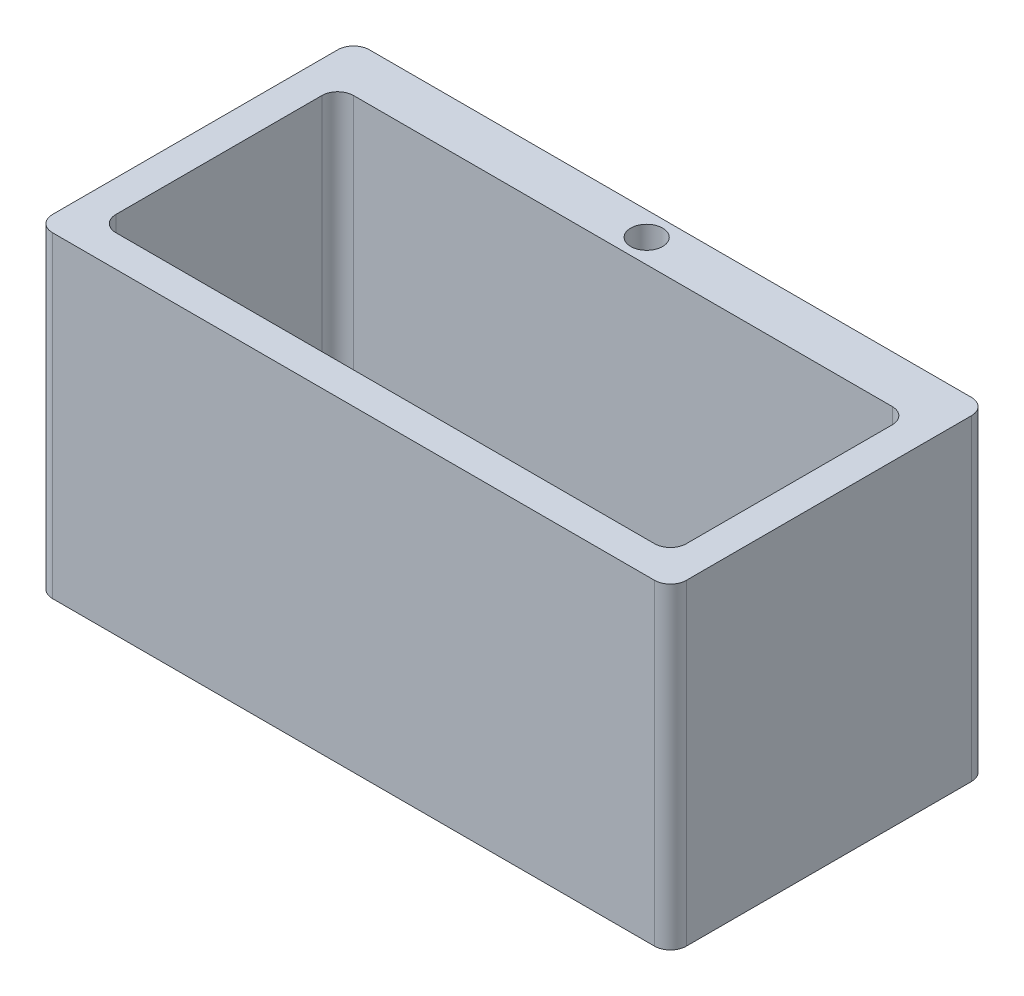
ISO-10303-21;
HEADER;
FILE_DESCRIPTION(('STEP AP214'),'2;1');
FILE_NAME('part.step','',(''),(''),'','','');
FILE_SCHEMA(('AUTOMOTIVE_DESIGN { 1 0 10303 214 1 1 1 1 }'));
ENDSEC;
DATA;
#1=APPLICATION_CONTEXT('core data for automotive mechanical design processes');
#2=APPLICATION_PROTOCOL_DEFINITION('international standard','automotive_design',2000,#1);
#3=PRODUCT_CONTEXT('',#1,'mechanical');
#4=PRODUCT('Part','Part','',(#3));
#5=PRODUCT_RELATED_PRODUCT_CATEGORY('part','',(#4));
#6=PRODUCT_DEFINITION_FORMATION('','',#4);
#7=PRODUCT_DEFINITION_CONTEXT('part definition',#1,'design');
#8=PRODUCT_DEFINITION('design','',#6,#7);
#9=PRODUCT_DEFINITION_SHAPE('','',#8);
#10=(LENGTH_UNIT() NAMED_UNIT(*) SI_UNIT(.MILLI.,.METRE.));
#11=(NAMED_UNIT(*) PLANE_ANGLE_UNIT() SI_UNIT($,.RADIAN.));
#12=(NAMED_UNIT(*) SI_UNIT($,.STERADIAN.) SOLID_ANGLE_UNIT());
#13=UNCERTAINTY_MEASURE_WITH_UNIT(LENGTH_MEASURE(1.E-05),#10,'distance_accuracy_value','');
#14=(GEOMETRIC_REPRESENTATION_CONTEXT(3) GLOBAL_UNCERTAINTY_ASSIGNED_CONTEXT((#13)) GLOBAL_UNIT_ASSIGNED_CONTEXT((#10,
#11,#12)) REPRESENTATION_CONTEXT('',''));
#15=CARTESIAN_POINT('',(0.,0.,0.));
#16=DIRECTION('',(0.,0.,1.));
#17=DIRECTION('',(1.,0.,0.));
#18=AXIS2_PLACEMENT_3D('',#15,#16,#17);
#19=CARTESIAN_POINT('',(-133.764264849075,-254.,173.261635832522));
#20=DIRECTION('',(0.,1.,0.));
#21=DIRECTION('',(0.,0.,1.));
#22=AXIS2_PLACEMENT_3D('',#19,#20,#21);
#23=CYLINDRICAL_SURFACE('',#22,12.7);
#24=CARTESIAN_POINT('',(-133.764264849075,0.,173.261635832522));
#25=DIRECTION('',(0.,1.,0.));
#26=DIRECTION('',(0.,0.,1.));
#27=AXIS2_PLACEMENT_3D('',#24,#25,#26);
#28=CIRCLE('',#27,12.7);
#29=CARTESIAN_POINT('',(-146.464264849075,0.,173.261635832522));
#30=VERTEX_POINT('',#29);
#31=CARTESIAN_POINT('',(-133.764264849075,0.,185.961635832522));
#32=VERTEX_POINT('',#31);
#33=EDGE_CURVE('E144',#30,#32,#28,.T.);
#34=ORIENTED_EDGE('',*,*,#33,.F.);
#35=DIRECTION('',(0.,1.,0.));
#36=VECTOR('',#35,1.);
#37=CARTESIAN_POINT('',(-146.464264849075,-254.,173.261635832522));
#38=LINE('',#37,#36);
#39=CARTESIAN_POINT('',(-146.464264849075,-254.,173.261635832522));
#40=VERTEX_POINT('',#39);
#41=EDGE_CURVE('E11',#40,#30,#38,.T.);
#42=ORIENTED_EDGE('',*,*,#41,.F.);
#43=CARTESIAN_POINT('',(-133.764264849075,-254.,173.261635832522));
#44=DIRECTION('',(0.,1.,0.));
#45=DIRECTION('',(0.,0.,1.));
#46=AXIS2_PLACEMENT_3D('',#43,#44,#45);
#47=CIRCLE('',#46,12.7);
#48=CARTESIAN_POINT('',(-133.764264849075,-254.,185.961635832522));
#49=VERTEX_POINT('',#48);
#50=EDGE_CURVE('E165',#40,#49,#47,.T.);
#51=ORIENTED_EDGE('',*,*,#50,.T.);
#52=DIRECTION('',(0.,1.,0.));
#53=VECTOR('',#52,1.);
#54=CARTESIAN_POINT('',(-133.764264849075,-254.,185.961635832522));
#55=LINE('',#54,#53);
#56=EDGE_CURVE('E95',#49,#32,#55,.T.);
#57=ORIENTED_EDGE('',*,*,#56,.T.);
#58=EDGE_LOOP('',(#34,#42,#51,#57));
#59=FACE_BOUND('',#58,.T.);
#60=ADVANCED_FACE('F33',(#59),#23,.T.);
#61=CARTESIAN_POINT('',(-146.464264849075,-254.,-55.338364167478));
#62=DIRECTION('',(-1.,0.,0.));
#63=DIRECTION('',(0.,0.,1.));
#64=AXIS2_PLACEMENT_3D('',#61,#62,#63);
#65=PLANE('',#64);
#66=DIRECTION('',(0.,0.,1.));
#67=VECTOR('',#66,1.);
#68=CARTESIAN_POINT('',(-146.464264849075,0.,-55.338364167478));
#69=LINE('',#68,#67);
#70=CARTESIAN_POINT('',(-146.464264849075,0.,-55.338364167478));
#71=VERTEX_POINT('',#70);
#72=EDGE_CURVE('E163',#71,#30,#69,.T.);
#73=ORIENTED_EDGE('',*,*,#72,.F.);
#74=DIRECTION('',(0.,1.,0.));
#75=VECTOR('',#74,1.);
#76=CARTESIAN_POINT('',(-146.464264849075,-254.,-55.338364167478));
#77=LINE('',#76,#75);
#78=CARTESIAN_POINT('',(-146.464264849075,-254.,-55.338364167478));
#79=VERTEX_POINT('',#78);
#80=EDGE_CURVE('E41',#79,#71,#77,.T.);
#81=ORIENTED_EDGE('',*,*,#80,.F.);
#82=DIRECTION('',(0.,0.,1.));
#83=VECTOR('',#82,1.);
#84=CARTESIAN_POINT('',(-146.464264849075,-254.,-55.338364167478));
#85=LINE('',#84,#83);
#86=EDGE_CURVE('E134',#79,#40,#85,.T.);
#87=ORIENTED_EDGE('',*,*,#86,.T.);
#88=ORIENTED_EDGE('',*,*,#41,.T.);
#89=EDGE_LOOP('',(#73,#81,#87,#88));
#90=FACE_BOUND('',#89,.T.);
#91=ADVANCED_FACE('F178',(#90),#65,.T.);
#92=CARTESIAN_POINT('',(-133.764264849075,-254.,-55.3383641674781));
#93=DIRECTION('',(0.,1.,0.));
#94=DIRECTION('',(0.,0.,1.));
#95=AXIS2_PLACEMENT_3D('',#92,#93,#94);
#96=CYLINDRICAL_SURFACE('',#95,12.7);
#97=CARTESIAN_POINT('',(-133.764264849075,0.,-55.3383641674781));
#98=DIRECTION('',(0.,1.,0.));
#99=DIRECTION('',(0.,0.,1.));
#100=AXIS2_PLACEMENT_3D('',#97,#98,#99);
#101=CIRCLE('',#100,12.7);
#102=CARTESIAN_POINT('',(-133.764264849075,0.,-68.0383641674781));
#103=VERTEX_POINT('',#102);
#104=EDGE_CURVE('E121',#103,#71,#101,.T.);
#105=ORIENTED_EDGE('',*,*,#104,.F.);
#106=DIRECTION('',(0.,1.,0.));
#107=VECTOR('',#106,1.);
#108=CARTESIAN_POINT('',(-133.764264849075,-254.,-68.0383641674781));
#109=LINE('',#108,#107);
#110=CARTESIAN_POINT('',(-133.764264849075,-254.,-68.0383641674781));
#111=VERTEX_POINT('',#110);
#112=EDGE_CURVE('E115',#111,#103,#109,.T.);
#113=ORIENTED_EDGE('',*,*,#112,.F.);
#114=CARTESIAN_POINT('',(-133.764264849075,-254.,-55.3383641674781));
#115=DIRECTION('',(0.,1.,0.));
#116=DIRECTION('',(0.,0.,1.));
#117=AXIS2_PLACEMENT_3D('',#114,#115,#116);
#118=CIRCLE('',#117,12.7);
#119=EDGE_CURVE('E118',#111,#79,#118,.T.);
#120=ORIENTED_EDGE('',*,*,#119,.T.);
#121=ORIENTED_EDGE('',*,*,#80,.T.);
#122=EDGE_LOOP('',(#105,#113,#120,#121));
#123=FACE_BOUND('',#122,.T.);
#124=ADVANCED_FACE('F117',(#123),#96,.T.);
#125=CARTESIAN_POINT('',(-133.764264849075,-254.,-68.0383641674781));
#126=DIRECTION('',(0.,0.,-1.));
#127=DIRECTION('',(-1.,0.,0.));
#128=AXIS2_PLACEMENT_3D('',#125,#126,#127);
#129=PLANE('',#128);
#130=DIRECTION('',(-1.,0.,0.));
#131=VECTOR('',#130,1.);
#132=CARTESIAN_POINT('',(-133.764264849075,0.,-68.0383641674781));
#133=LINE('',#132,#131);
#134=CARTESIAN_POINT('',(348.835735150925,0.,-68.0383641674781));
#135=VERTEX_POINT('',#134);
#136=EDGE_CURVE('E160',#135,#103,#133,.T.);
#137=ORIENTED_EDGE('',*,*,#136,.F.);
#138=DIRECTION('',(0.,1.,0.));
#139=VECTOR('',#138,1.);
#140=CARTESIAN_POINT('',(348.835735150925,-254.,-68.0383641674781));
#141=LINE('',#140,#139);
#142=CARTESIAN_POINT('',(348.835735150925,-254.,-68.0383641674781));
#143=VERTEX_POINT('',#142);
#144=EDGE_CURVE('E126',#143,#135,#141,.T.);
#145=ORIENTED_EDGE('',*,*,#144,.F.);
#146=DIRECTION('',(-1.,0.,0.));
#147=VECTOR('',#146,1.);
#148=CARTESIAN_POINT('',(-133.764264849075,-254.,-68.0383641674781));
#149=LINE('',#148,#147);
#150=EDGE_CURVE('E132',#143,#111,#149,.T.);
#151=ORIENTED_EDGE('',*,*,#150,.T.);
#152=ORIENTED_EDGE('',*,*,#112,.T.);
#153=EDGE_LOOP('',(#137,#145,#151,#152));
#154=FACE_BOUND('',#153,.T.);
#155=ADVANCED_FACE('F136',(#154),#129,.T.);
#156=CARTESIAN_POINT('',(348.835735150925,-254.,-55.3383641674781));
#157=DIRECTION('',(0.,1.,0.));
#158=DIRECTION('',(0.,0.,1.));
#159=AXIS2_PLACEMENT_3D('',#156,#157,#158);
#160=CYLINDRICAL_SURFACE('',#159,12.7);
#161=CARTESIAN_POINT('',(348.835735150925,0.,-55.3383641674781));
#162=DIRECTION('',(0.,1.,0.));
#163=DIRECTION('',(0.,0.,-1.));
#164=AXIS2_PLACEMENT_3D('',#161,#162,#163);
#165=CIRCLE('',#164,12.7);
#166=CARTESIAN_POINT('',(361.535735150925,0.,-55.338364167478));
#167=VERTEX_POINT('',#166);
#168=EDGE_CURVE('E157',#167,#135,#165,.T.);
#169=ORIENTED_EDGE('',*,*,#168,.F.);
#170=DIRECTION('',(0.,1.,0.));
#171=VECTOR('',#170,1.);
#172=CARTESIAN_POINT('',(361.535735150925,-254.,-55.338364167478));
#173=LINE('',#172,#171);
#174=CARTESIAN_POINT('',(361.535735150925,-254.,-55.338364167478));
#175=VERTEX_POINT('',#174);
#176=EDGE_CURVE('E169',#175,#167,#173,.T.);
#177=ORIENTED_EDGE('',*,*,#176,.F.);
#178=CARTESIAN_POINT('',(348.835735150925,-254.,-55.3383641674781));
#179=DIRECTION('',(0.,1.,0.));
#180=DIRECTION('',(0.,0.,-1.));
#181=AXIS2_PLACEMENT_3D('',#178,#179,#180);
#182=CIRCLE('',#181,12.7);
#183=EDGE_CURVE('E137',#175,#143,#182,.T.);
#184=ORIENTED_EDGE('',*,*,#183,.T.);
#185=ORIENTED_EDGE('',*,*,#144,.T.);
#186=EDGE_LOOP('',(#169,#177,#184,#185));
#187=FACE_BOUND('',#186,.T.);
#188=ADVANCED_FACE('F191',(#187),#160,.T.);
#189=CARTESIAN_POINT('',(361.535735150925,-254.,-55.338364167478));
#190=DIRECTION('',(1.,0.,0.));
#191=DIRECTION('',(0.,0.,-1.));
#192=AXIS2_PLACEMENT_3D('',#189,#190,#191);
#193=PLANE('',#192);
#194=DIRECTION('',(0.,0.,-1.));
#195=VECTOR('',#194,1.);
#196=CARTESIAN_POINT('',(361.535735150925,0.,-55.338364167478));
#197=LINE('',#196,#195);
#198=CARTESIAN_POINT('',(361.535735150925,0.,173.261635832522));
#199=VERTEX_POINT('',#198);
#200=EDGE_CURVE('E154',#199,#167,#197,.T.);
#201=ORIENTED_EDGE('',*,*,#200,.F.);
#202=DIRECTION('',(0.,1.,0.));
#203=VECTOR('',#202,1.);
#204=CARTESIAN_POINT('',(361.535735150925,-254.,173.261635832522));
#205=LINE('',#204,#203);
#206=CARTESIAN_POINT('',(361.535735150925,-254.,173.261635832522));
#207=VERTEX_POINT('',#206);
#208=EDGE_CURVE('E171',#207,#199,#205,.T.);
#209=ORIENTED_EDGE('',*,*,#208,.F.);
#210=DIRECTION('',(0.,0.,-1.));
#211=VECTOR('',#210,1.);
#212=CARTESIAN_POINT('',(361.535735150925,-254.,-55.338364167478));
#213=LINE('',#212,#211);
#214=EDGE_CURVE('E139',#207,#175,#213,.T.);
#215=ORIENTED_EDGE('',*,*,#214,.T.);
#216=ORIENTED_EDGE('',*,*,#176,.T.);
#217=EDGE_LOOP('',(#201,#209,#215,#216));
#218=FACE_BOUND('',#217,.T.);
#219=ADVANCED_FACE('F194',(#218),#193,.T.);
#220=CARTESIAN_POINT('',(348.835735150925,-254.,173.261635832522));
#221=DIRECTION('',(0.,1.,0.));
#222=DIRECTION('',(0.,0.,1.));
#223=AXIS2_PLACEMENT_3D('',#220,#221,#222);
#224=CYLINDRICAL_SURFACE('',#223,12.7);
#225=CARTESIAN_POINT('',(348.835735150925,0.,173.261635832522));
#226=DIRECTION('',(0.,1.,0.));
#227=DIRECTION('',(0.,0.,1.));
#228=AXIS2_PLACEMENT_3D('',#225,#226,#227);
#229=CIRCLE('',#228,12.7);
#230=CARTESIAN_POINT('',(348.835735150925,0.,185.961635832522));
#231=VERTEX_POINT('',#230);
#232=EDGE_CURVE('E151',#231,#199,#229,.T.);
#233=ORIENTED_EDGE('',*,*,#232,.F.);
#234=DIRECTION('',(0.,1.,0.));
#235=VECTOR('',#234,1.);
#236=CARTESIAN_POINT('',(348.835735150925,-254.,185.961635832522));
#237=LINE('',#236,#235);
#238=CARTESIAN_POINT('',(348.835735150925,-254.,185.961635832522));
#239=VERTEX_POINT('',#238);
#240=EDGE_CURVE('E173',#239,#231,#237,.T.);
#241=ORIENTED_EDGE('',*,*,#240,.F.);
#242=CARTESIAN_POINT('',(348.835735150925,-254.,173.261635832522));
#243=DIRECTION('',(0.,1.,0.));
#244=DIRECTION('',(0.,0.,1.));
#245=AXIS2_PLACEMENT_3D('',#242,#243,#244);
#246=CIRCLE('',#245,12.7);
#247=EDGE_CURVE('E306',#239,#207,#246,.T.);
#248=ORIENTED_EDGE('',*,*,#247,.T.);
#249=ORIENTED_EDGE('',*,*,#208,.T.);
#250=EDGE_LOOP('',(#233,#241,#248,#249));
#251=FACE_BOUND('',#250,.T.);
#252=ADVANCED_FACE('F198',(#251),#224,.T.);
#253=CARTESIAN_POINT('',(-133.764264849075,-254.,185.961635832522));
#254=DIRECTION('',(0.,0.,1.));
#255=DIRECTION('',(1.,0.,0.));
#256=AXIS2_PLACEMENT_3D('',#253,#254,#255);
#257=PLANE('',#256);
#258=DIRECTION('',(1.,0.,0.));
#259=VECTOR('',#258,1.);
#260=CARTESIAN_POINT('',(-133.764264849075,0.,185.961635832522));
#261=LINE('',#260,#259);
#262=EDGE_CURVE('E147',#32,#231,#261,.T.);
#263=ORIENTED_EDGE('',*,*,#262,.F.);
#264=ORIENTED_EDGE('',*,*,#56,.F.);
#265=DIRECTION('',(1.,0.,0.));
#266=VECTOR('',#265,1.);
#267=CARTESIAN_POINT('',(-133.764264849075,-254.,185.961635832522));
#268=LINE('',#267,#266);
#269=EDGE_CURVE('E304',#49,#239,#268,.T.);
#270=ORIENTED_EDGE('',*,*,#269,.T.);
#271=ORIENTED_EDGE('',*,*,#240,.T.);
#272=EDGE_LOOP('',(#263,#264,#270,#271));
#273=FACE_BOUND('',#272,.T.);
#274=ADVANCED_FACE('F174',(#273),#257,.T.);
#275=CARTESIAN_POINT('',(-133.764264849075,-254.,173.261635832522));
#276=DIRECTION('',(0.,1.,0.));
#277=DIRECTION('',(0.,0.,1.));
#278=AXIS2_PLACEMENT_3D('',#275,#276,#277);
#279=PLANE('',#278);
#280=CARTESIAN_POINT('',(107.535735150925,-254.,69.4233690360273));
#281=DIRECTION('',(0.,1.,0.));
#282=DIRECTION('',(0.,0.,1.));
#283=AXIS2_PLACEMENT_3D('',#280,#281,#282);
#284=CIRCLE('',#283,19.6876627373123);
#285=CARTESIAN_POINT('',(107.535735150925,-254.,89.1110317733396));
#286=VERTEX_POINT('',#285);
#287=EDGE_CURVE('E267',#286,#286,#284,.T.);
#288=ORIENTED_EDGE('',*,*,#287,.T.);
#289=EDGE_LOOP('',(#288));
#290=FACE_BOUND('',#289,.T.);
#291=CARTESIAN_POINT('',(107.535735150925,-254.,-48.9883641674781));
#292=DIRECTION('',(0.,1.,0.));
#293=DIRECTION('',(0.,0.,1.));
#294=AXIS2_PLACEMENT_3D('',#291,#292,#293);
#295=CIRCLE('',#294,12.8112950340798);
#296=CARTESIAN_POINT('',(107.535735150925,-254.,-36.1770691333982));
#297=VERTEX_POINT('',#296);
#298=EDGE_CURVE('E148',#297,#297,#295,.T.);
#299=ORIENTED_EDGE('',*,*,#298,.T.);
#300=EDGE_LOOP('',(#299));
#301=FACE_BOUND('',#300,.T.);
#302=ORIENTED_EDGE('',*,*,#50,.F.);
#303=ORIENTED_EDGE('',*,*,#86,.F.);
#304=ORIENTED_EDGE('',*,*,#119,.F.);
#305=ORIENTED_EDGE('',*,*,#150,.F.);
#306=ORIENTED_EDGE('',*,*,#183,.F.);
#307=ORIENTED_EDGE('',*,*,#214,.F.);
#308=ORIENTED_EDGE('',*,*,#247,.F.);
#309=ORIENTED_EDGE('',*,*,#269,.F.);
#310=EDGE_LOOP('',(#302,#303,#304,#305,#306,#307,#308,#309));
#311=FACE_BOUND('',#310,.T.);
#312=ADVANCED_FACE('F130',(#290,#301,#311),#279,.F.);
#313=CARTESIAN_POINT('',(-133.764264849075,0.,173.261635832522));
#314=DIRECTION('',(0.,1.,0.));
#315=DIRECTION('',(0.,0.,1.));
#316=AXIS2_PLACEMENT_3D('',#313,#314,#315);
#317=PLANE('',#316);
#318=CARTESIAN_POINT('',(323.435735150925,0.,-17.2383641674781));
#319=DIRECTION('',(0.,1.,0.));
#320=DIRECTION('',(0.,0.,-1.));
#321=AXIS2_PLACEMENT_3D('',#318,#319,#320);
#322=CIRCLE('',#321,12.7);
#323=CARTESIAN_POINT('',(336.135735150925,0.,-17.238364167478));
#324=VERTEX_POINT('',#323);
#325=CARTESIAN_POINT('',(323.435735150925,0.,-29.9383641674781));
#326=VERTEX_POINT('',#325);
#327=EDGE_CURVE('E49',#324,#326,#322,.T.);
#328=ORIENTED_EDGE('',*,*,#327,.F.);
#329=DIRECTION('',(0.,0.,-1.));
#330=VECTOR('',#329,1.);
#331=CARTESIAN_POINT('',(336.135735150925,0.,-17.238364167478));
#332=LINE('',#331,#330);
#333=CARTESIAN_POINT('',(336.135735150925,0.,147.861635832522));
#334=VERTEX_POINT('',#333);
#335=EDGE_CURVE('E279',#334,#324,#332,.T.);
#336=ORIENTED_EDGE('',*,*,#335,.F.);
#337=CARTESIAN_POINT('',(323.435735150925,0.,147.861635832522));
#338=DIRECTION('',(0.,1.,0.));
#339=DIRECTION('',(0.,0.,1.));
#340=AXIS2_PLACEMENT_3D('',#337,#338,#339);
#341=CIRCLE('',#340,12.7);
#342=CARTESIAN_POINT('',(323.435735150925,0.,160.561635832522));
#343=VERTEX_POINT('',#342);
#344=EDGE_CURVE('E342',#343,#334,#341,.T.);
#345=ORIENTED_EDGE('',*,*,#344,.F.);
#346=DIRECTION('',(1.,0.,0.));
#347=VECTOR('',#346,1.);
#348=CARTESIAN_POINT('',(-108.364264849075,0.,160.561635832522));
#349=LINE('',#348,#347);
#350=CARTESIAN_POINT('',(-108.364264849075,0.,160.561635832522));
#351=VERTEX_POINT('',#350);
#352=EDGE_CURVE('E340',#351,#343,#349,.T.);
#353=ORIENTED_EDGE('',*,*,#352,.F.);
#354=CARTESIAN_POINT('',(-108.364264849075,0.,147.861635832522));
#355=DIRECTION('',(0.,1.,0.));
#356=DIRECTION('',(0.,0.,1.));
#357=AXIS2_PLACEMENT_3D('',#354,#355,#356);
#358=CIRCLE('',#357,12.7);
#359=CARTESIAN_POINT('',(-121.064264849075,0.,147.861635832522));
#360=VERTEX_POINT('',#359);
#361=EDGE_CURVE('E337',#360,#351,#358,.T.);
#362=ORIENTED_EDGE('',*,*,#361,.F.);
#363=DIRECTION('',(0.,0.,1.));
#364=VECTOR('',#363,1.);
#365=CARTESIAN_POINT('',(-121.064264849075,0.,-17.238364167478));
#366=LINE('',#365,#364);
#367=CARTESIAN_POINT('',(-121.064264849075,0.,-17.238364167478));
#368=VERTEX_POINT('',#367);
#369=EDGE_CURVE('E334',#368,#360,#366,.T.);
#370=ORIENTED_EDGE('',*,*,#369,.F.);
#371=CARTESIAN_POINT('',(-108.364264849075,0.,-17.2383641674781));
#372=DIRECTION('',(0.,1.,0.));
#373=DIRECTION('',(0.,0.,1.));
#374=AXIS2_PLACEMENT_3D('',#371,#372,#373);
#375=CIRCLE('',#374,12.7);
#376=CARTESIAN_POINT('',(-108.364264849075,0.,-29.9383641674781));
#377=VERTEX_POINT('',#376);
#378=EDGE_CURVE('E331',#377,#368,#375,.T.);
#379=ORIENTED_EDGE('',*,*,#378,.F.);
#380=DIRECTION('',(-1.,0.,0.));
#381=VECTOR('',#380,1.);
#382=CARTESIAN_POINT('',(-108.364264849075,0.,-29.9383641674781));
#383=LINE('',#382,#381);
#384=EDGE_CURVE('E329',#326,#377,#383,.T.);
#385=ORIENTED_EDGE('',*,*,#384,.F.);
#386=EDGE_LOOP('',(#328,#336,#345,#353,#362,#370,#379,#385));
#387=FACE_BOUND('',#386,.T.);
#388=CARTESIAN_POINT('',(107.535735150925,0.,-48.9883641674781));
#389=DIRECTION('',(0.,1.,0.));
#390=DIRECTION('',(0.,0.,1.));
#391=AXIS2_PLACEMENT_3D('',#388,#389,#390);
#392=CIRCLE('',#391,12.8112950340798);
#393=CARTESIAN_POINT('',(107.535735150925,0.,-36.1770691333982));
#394=VERTEX_POINT('',#393);
#395=EDGE_CURVE('E269',#394,#394,#392,.T.);
#396=ORIENTED_EDGE('',*,*,#395,.F.);
#397=EDGE_LOOP('',(#396));
#398=FACE_BOUND('',#397,.T.);
#399=ORIENTED_EDGE('',*,*,#33,.T.);
#400=ORIENTED_EDGE('',*,*,#262,.T.);
#401=ORIENTED_EDGE('',*,*,#232,.T.);
#402=ORIENTED_EDGE('',*,*,#200,.T.);
#403=ORIENTED_EDGE('',*,*,#168,.T.);
#404=ORIENTED_EDGE('',*,*,#136,.T.);
#405=ORIENTED_EDGE('',*,*,#104,.T.);
#406=ORIENTED_EDGE('',*,*,#72,.T.);
#407=EDGE_LOOP('',(#399,#400,#401,#402,#403,#404,#405,#406));
#408=FACE_BOUND('',#407,.T.);
#409=ADVANCED_FACE('F177',(#387,#398,#408),#317,.T.);
#410=CARTESIAN_POINT('',(107.535735150925,-254.,-48.9883641674781));
#411=DIRECTION('',(0.,1.,0.));
#412=DIRECTION('',(0.,0.,1.));
#413=AXIS2_PLACEMENT_3D('',#410,#411,#412);
#414=CYLINDRICAL_SURFACE('',#413,12.8112950340798);
#415=ORIENTED_EDGE('',*,*,#298,.F.);
#416=EDGE_LOOP('',(#415));
#417=FACE_BOUND('',#416,.T.);
#418=ORIENTED_EDGE('',*,*,#395,.T.);
#419=EDGE_LOOP('',(#418));
#420=FACE_BOUND('',#419,.T.);
#421=ADVANCED_FACE('F210',(#417,#420),#414,.F.);
#422=CARTESIAN_POINT('',(107.535735150925,-254.,69.4233690360273));
#423=DIRECTION('',(0.,1.,0.));
#424=DIRECTION('',(0.,0.,1.));
#425=AXIS2_PLACEMENT_3D('',#422,#423,#424);
#426=CYLINDRICAL_SURFACE('',#425,19.6876627373123);
#427=CARTESIAN_POINT('',(107.535735150925,-241.3,69.4233690360273));
#428=DIRECTION('',(0.,-1.,0.));
#429=DIRECTION('',(0.,0.,-1.));
#430=AXIS2_PLACEMENT_3D('',#427,#428,#429);
#431=CIRCLE('',#430,19.6876627373123);
#432=CARTESIAN_POINT('',(107.535735150925,-241.3,49.7357062987149));
#433=VERTEX_POINT('',#432);
#434=EDGE_CURVE('E36',#433,#433,#431,.F.);
#435=ORIENTED_EDGE('',*,*,#434,.T.);
#436=EDGE_LOOP('',(#435));
#437=FACE_BOUND('',#436,.T.);
#438=ORIENTED_EDGE('',*,*,#287,.F.);
#439=EDGE_LOOP('',(#438));
#440=FACE_BOUND('',#439,.T.);
#441=ADVANCED_FACE('F217',(#437,#440),#426,.F.);
#442=CARTESIAN_POINT('',(323.435735150925,-241.3,-17.2383641674781));
#443=DIRECTION('',(0.,-1.,0.));
#444=DIRECTION('',(0.,0.,-1.));
#445=AXIS2_PLACEMENT_3D('',#442,#443,#444);
#446=PLANE('',#445);
#447=CARTESIAN_POINT('',(323.435735150925,-241.3,-17.2383641674781));
#448=DIRECTION('',(0.,1.,0.));
#449=DIRECTION('',(0.,0.,-1.));
#450=AXIS2_PLACEMENT_3D('',#447,#448,#449);
#451=CIRCLE('',#450,12.7);
#452=CARTESIAN_POINT('',(336.135735150925,-241.3,-17.238364167478));
#453=VERTEX_POINT('',#452);
#454=CARTESIAN_POINT('',(323.435735150925,-241.3,-29.9383641674781));
#455=VERTEX_POINT('',#454);
#456=EDGE_CURVE('E264',#453,#455,#451,.T.);
#457=ORIENTED_EDGE('',*,*,#456,.T.);
#458=DIRECTION('',(-1.,0.,0.));
#459=VECTOR('',#458,1.);
#460=CARTESIAN_POINT('',(-108.364264849075,-241.3,-29.9383641674781));
#461=LINE('',#460,#459);
#462=CARTESIAN_POINT('',(-108.364264849075,-241.3,-29.9383641674781));
#463=VERTEX_POINT('',#462);
#464=EDGE_CURVE('E348',#455,#463,#461,.T.);
#465=ORIENTED_EDGE('',*,*,#464,.T.);
#466=CARTESIAN_POINT('',(-108.364264849075,-241.3,-17.2383641674781));
#467=DIRECTION('',(0.,1.,0.));
#468=DIRECTION('',(0.,0.,1.));
#469=AXIS2_PLACEMENT_3D('',#466,#467,#468);
#470=CIRCLE('',#469,12.7);
#471=CARTESIAN_POINT('',(-121.064264849075,-241.3,-17.238364167478));
#472=VERTEX_POINT('',#471);
#473=EDGE_CURVE('E350',#463,#472,#470,.T.);
#474=ORIENTED_EDGE('',*,*,#473,.T.);
#475=DIRECTION('',(0.,0.,1.));
#476=VECTOR('',#475,1.);
#477=CARTESIAN_POINT('',(-121.064264849075,-241.3,-17.238364167478));
#478=LINE('',#477,#476);
#479=CARTESIAN_POINT('',(-121.064264849075,-241.3,147.861635832522));
#480=VERTEX_POINT('',#479);
#481=EDGE_CURVE('E355',#472,#480,#478,.T.);
#482=ORIENTED_EDGE('',*,*,#481,.T.);
#483=CARTESIAN_POINT('',(-108.364264849075,-241.3,147.861635832522));
#484=DIRECTION('',(0.,1.,0.));
#485=DIRECTION('',(0.,0.,1.));
#486=AXIS2_PLACEMENT_3D('',#483,#484,#485);
#487=CIRCLE('',#486,12.7);
#488=CARTESIAN_POINT('',(-108.364264849075,-241.3,160.561635832522));
#489=VERTEX_POINT('',#488);
#490=EDGE_CURVE('E358',#480,#489,#487,.T.);
#491=ORIENTED_EDGE('',*,*,#490,.T.);
#492=DIRECTION('',(1.,0.,0.));
#493=VECTOR('',#492,1.);
#494=CARTESIAN_POINT('',(-108.364264849075,-241.3,160.561635832522));
#495=LINE('',#494,#493);
#496=CARTESIAN_POINT('',(323.435735150925,-241.3,160.561635832522));
#497=VERTEX_POINT('',#496);
#498=EDGE_CURVE('E324',#489,#497,#495,.T.);
#499=ORIENTED_EDGE('',*,*,#498,.T.);
#500=CARTESIAN_POINT('',(323.435735150925,-241.3,147.861635832522));
#501=DIRECTION('',(0.,1.,0.));
#502=DIRECTION('',(0.,0.,1.));
#503=AXIS2_PLACEMENT_3D('',#500,#501,#502);
#504=CIRCLE('',#503,12.7);
#505=CARTESIAN_POINT('',(336.135735150925,-241.3,147.861635832522));
#506=VERTEX_POINT('',#505);
#507=EDGE_CURVE('E320',#497,#506,#504,.T.);
#508=ORIENTED_EDGE('',*,*,#507,.T.);
#509=DIRECTION('',(0.,0.,-1.));
#510=VECTOR('',#509,1.);
#511=CARTESIAN_POINT('',(336.135735150925,-241.3,-17.238364167478));
#512=LINE('',#511,#510);
#513=EDGE_CURVE('E297',#506,#453,#512,.T.);
#514=ORIENTED_EDGE('',*,*,#513,.T.);
#515=EDGE_LOOP('',(#457,#465,#474,#482,#491,#499,#508,#514));
#516=FACE_BOUND('',#515,.T.);
#517=ORIENTED_EDGE('',*,*,#434,.F.);
#518=EDGE_LOOP('',(#517));
#519=FACE_BOUND('',#518,.T.);
#520=ADVANCED_FACE('F221',(#516,#519),#446,.F.);
#521=CARTESIAN_POINT('',(323.435735150925,-241.3,-17.2383641674781));
#522=DIRECTION('',(0.,1.,0.));
#523=DIRECTION('',(0.,0.,1.));
#524=AXIS2_PLACEMENT_3D('',#521,#522,#523);
#525=CYLINDRICAL_SURFACE('',#524,12.7);
#526=ORIENTED_EDGE('',*,*,#327,.T.);
#527=DIRECTION('',(0.,1.,0.));
#528=VECTOR('',#527,1.);
#529=CARTESIAN_POINT('',(323.435735150925,-241.3,-29.9383641674781));
#530=LINE('',#529,#528);
#531=EDGE_CURVE('E296',#455,#326,#530,.T.);
#532=ORIENTED_EDGE('',*,*,#531,.F.);
#533=ORIENTED_EDGE('',*,*,#456,.F.);
#534=DIRECTION('',(0.,1.,0.));
#535=VECTOR('',#534,1.);
#536=CARTESIAN_POINT('',(336.135735150925,-241.3,-17.238364167478));
#537=LINE('',#536,#535);
#538=EDGE_CURVE('E268',#453,#324,#537,.T.);
#539=ORIENTED_EDGE('',*,*,#538,.T.);
#540=EDGE_LOOP('',(#526,#532,#533,#539));
#541=FACE_BOUND('',#540,.T.);
#542=ADVANCED_FACE('F223',(#541),#525,.F.);
#543=CARTESIAN_POINT('',(336.135735150925,-241.3,-17.238364167478));
#544=DIRECTION('',(1.,0.,0.));
#545=DIRECTION('',(0.,0.,-1.));
#546=AXIS2_PLACEMENT_3D('',#543,#544,#545);
#547=PLANE('',#546);
#548=ORIENTED_EDGE('',*,*,#335,.T.);
#549=ORIENTED_EDGE('',*,*,#538,.F.);
#550=ORIENTED_EDGE('',*,*,#513,.F.);
#551=DIRECTION('',(0.,1.,0.));
#552=VECTOR('',#551,1.);
#553=CARTESIAN_POINT('',(336.135735150925,-241.3,147.861635832522));
#554=LINE('',#553,#552);
#555=EDGE_CURVE('E271',#506,#334,#554,.T.);
#556=ORIENTED_EDGE('',*,*,#555,.T.);
#557=EDGE_LOOP('',(#548,#549,#550,#556));
#558=FACE_BOUND('',#557,.T.);
#559=ADVANCED_FACE('F226',(#558),#547,.F.);
#560=CARTESIAN_POINT('',(323.435735150925,-241.3,147.861635832522));
#561=DIRECTION('',(0.,1.,0.));
#562=DIRECTION('',(0.,0.,1.));
#563=AXIS2_PLACEMENT_3D('',#560,#561,#562);
#564=CYLINDRICAL_SURFACE('',#563,12.7);
#565=ORIENTED_EDGE('',*,*,#344,.T.);
#566=ORIENTED_EDGE('',*,*,#555,.F.);
#567=ORIENTED_EDGE('',*,*,#507,.F.);
#568=DIRECTION('',(0.,1.,0.));
#569=VECTOR('',#568,1.);
#570=CARTESIAN_POINT('',(323.435735150925,-241.3,160.561635832522));
#571=LINE('',#570,#569);
#572=EDGE_CURVE('E276',#497,#343,#571,.T.);
#573=ORIENTED_EDGE('',*,*,#572,.T.);
#574=EDGE_LOOP('',(#565,#566,#567,#573));
#575=FACE_BOUND('',#574,.T.);
#576=ADVANCED_FACE('F246',(#575),#564,.F.);
#577=CARTESIAN_POINT('',(-108.364264849075,-241.3,160.561635832522));
#578=DIRECTION('',(0.,0.,1.));
#579=DIRECTION('',(1.,0.,0.));
#580=AXIS2_PLACEMENT_3D('',#577,#578,#579);
#581=PLANE('',#580);
#582=ORIENTED_EDGE('',*,*,#352,.T.);
#583=ORIENTED_EDGE('',*,*,#572,.F.);
#584=ORIENTED_EDGE('',*,*,#498,.F.);
#585=DIRECTION('',(0.,1.,0.));
#586=VECTOR('',#585,1.);
#587=CARTESIAN_POINT('',(-108.364264849075,-241.3,160.561635832522));
#588=LINE('',#587,#586);
#589=EDGE_CURVE('E284',#489,#351,#588,.T.);
#590=ORIENTED_EDGE('',*,*,#589,.T.);
#591=EDGE_LOOP('',(#582,#583,#584,#590));
#592=FACE_BOUND('',#591,.T.);
#593=ADVANCED_FACE('F242',(#592),#581,.F.);
#594=CARTESIAN_POINT('',(-108.364264849075,-241.3,147.861635832522));
#595=DIRECTION('',(0.,1.,0.));
#596=DIRECTION('',(0.,0.,1.));
#597=AXIS2_PLACEMENT_3D('',#594,#595,#596);
#598=CYLINDRICAL_SURFACE('',#597,12.7);
#599=ORIENTED_EDGE('',*,*,#361,.T.);
#600=ORIENTED_EDGE('',*,*,#589,.F.);
#601=ORIENTED_EDGE('',*,*,#490,.F.);
#602=DIRECTION('',(0.,1.,0.));
#603=VECTOR('',#602,1.);
#604=CARTESIAN_POINT('',(-121.064264849075,-241.3,147.861635832522));
#605=LINE('',#604,#603);
#606=EDGE_CURVE('E287',#480,#360,#605,.T.);
#607=ORIENTED_EDGE('',*,*,#606,.T.);
#608=EDGE_LOOP('',(#599,#600,#601,#607));
#609=FACE_BOUND('',#608,.T.);
#610=ADVANCED_FACE('F238',(#609),#598,.F.);
#611=CARTESIAN_POINT('',(-121.064264849075,-241.3,-17.238364167478));
#612=DIRECTION('',(-1.,0.,0.));
#613=DIRECTION('',(0.,0.,1.));
#614=AXIS2_PLACEMENT_3D('',#611,#612,#613);
#615=PLANE('',#614);
#616=ORIENTED_EDGE('',*,*,#369,.T.);
#617=ORIENTED_EDGE('',*,*,#606,.F.);
#618=ORIENTED_EDGE('',*,*,#481,.F.);
#619=DIRECTION('',(0.,1.,0.));
#620=VECTOR('',#619,1.);
#621=CARTESIAN_POINT('',(-121.064264849075,-241.3,-17.238364167478));
#622=LINE('',#621,#620);
#623=EDGE_CURVE('E290',#472,#368,#622,.T.);
#624=ORIENTED_EDGE('',*,*,#623,.T.);
#625=EDGE_LOOP('',(#616,#617,#618,#624));
#626=FACE_BOUND('',#625,.T.);
#627=ADVANCED_FACE('F234',(#626),#615,.F.);
#628=CARTESIAN_POINT('',(-108.364264849075,-241.3,-17.2383641674781));
#629=DIRECTION('',(0.,1.,0.));
#630=DIRECTION('',(0.,0.,1.));
#631=AXIS2_PLACEMENT_3D('',#628,#629,#630);
#632=CYLINDRICAL_SURFACE('',#631,12.7);
#633=ORIENTED_EDGE('',*,*,#378,.T.);
#634=ORIENTED_EDGE('',*,*,#623,.F.);
#635=ORIENTED_EDGE('',*,*,#473,.F.);
#636=DIRECTION('',(0.,1.,0.));
#637=VECTOR('',#636,1.);
#638=CARTESIAN_POINT('',(-108.364264849075,-241.3,-29.9383641674781));
#639=LINE('',#638,#637);
#640=EDGE_CURVE('E293',#463,#377,#639,.T.);
#641=ORIENTED_EDGE('',*,*,#640,.T.);
#642=EDGE_LOOP('',(#633,#634,#635,#641));
#643=FACE_BOUND('',#642,.T.);
#644=ADVANCED_FACE('F230',(#643),#632,.F.);
#645=CARTESIAN_POINT('',(-108.364264849075,-241.3,-29.9383641674781));
#646=DIRECTION('',(0.,0.,-1.));
#647=DIRECTION('',(-1.,0.,0.));
#648=AXIS2_PLACEMENT_3D('',#645,#646,#647);
#649=PLANE('',#648);
#650=ORIENTED_EDGE('',*,*,#384,.T.);
#651=ORIENTED_EDGE('',*,*,#640,.F.);
#652=ORIENTED_EDGE('',*,*,#464,.F.);
#653=ORIENTED_EDGE('',*,*,#531,.T.);
#654=EDGE_LOOP('',(#650,#651,#652,#653));
#655=FACE_BOUND('',#654,.T.);
#656=ADVANCED_FACE('F227',(#655),#649,.F.);
#657=CLOSED_SHELL('',(#60,#91,#124,#155,#188,#219,#252,#274,#312,#409,#421,#441,#520,#542,#559,
#576,#593,#610,#627,#644,#656));
#658=MANIFOLD_SOLID_BREP('B2',#657);
#659=ADVANCED_BREP_SHAPE_REPRESENTATION('',(#18,#658),#14);
#660=SHAPE_DEFINITION_REPRESENTATION(#9,#659);
ENDSEC;
END-ISO-10303-21;
